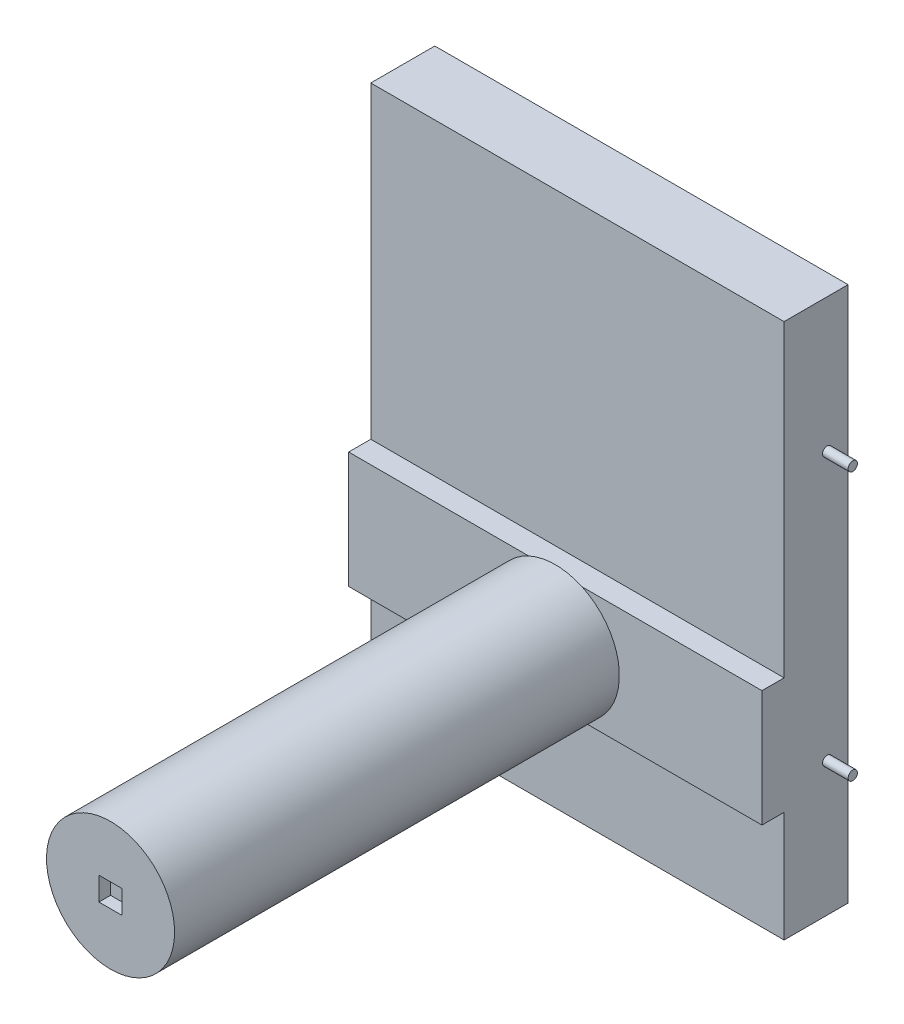
ISO-10303-21;
HEADER;
FILE_DESCRIPTION(('STEP AP214'),'2;1');
FILE_NAME('part.step','',(''),(''),'','','');
FILE_SCHEMA(('AUTOMOTIVE_DESIGN { 1 0 10303 214 1 1 1 1 }'));
ENDSEC;
DATA;
#1=APPLICATION_CONTEXT('core data for automotive mechanical design processes');
#2=APPLICATION_PROTOCOL_DEFINITION('international standard','automotive_design',2000,#1);
#3=PRODUCT_CONTEXT('',#1,'mechanical');
#4=PRODUCT('Part','Part','',(#3));
#5=PRODUCT_RELATED_PRODUCT_CATEGORY('part','',(#4));
#6=PRODUCT_DEFINITION_FORMATION('','',#4);
#7=PRODUCT_DEFINITION_CONTEXT('part definition',#1,'design');
#8=PRODUCT_DEFINITION('design','',#6,#7);
#9=PRODUCT_DEFINITION_SHAPE('','',#8);
#10=(LENGTH_UNIT() NAMED_UNIT(*) SI_UNIT(.MILLI.,.METRE.));
#11=(NAMED_UNIT(*) PLANE_ANGLE_UNIT() SI_UNIT($,.RADIAN.));
#12=(NAMED_UNIT(*) SI_UNIT($,.STERADIAN.) SOLID_ANGLE_UNIT());
#13=UNCERTAINTY_MEASURE_WITH_UNIT(LENGTH_MEASURE(1.E-05),#10,'distance_accuracy_value','');
#14=(GEOMETRIC_REPRESENTATION_CONTEXT(3) GLOBAL_UNCERTAINTY_ASSIGNED_CONTEXT((#13)) GLOBAL_UNIT_ASSIGNED_CONTEXT((#10,
#11,#12)) REPRESENTATION_CONTEXT('',''));
#15=CARTESIAN_POINT('',(0.,0.,0.));
#16=DIRECTION('',(0.,0.,1.));
#17=DIRECTION('',(1.,0.,0.));
#18=AXIS2_PLACEMENT_3D('',#15,#16,#17);
#19=CARTESIAN_POINT('',(177.500000000291,144.999998807907,487.999998748302));
#20=DIRECTION('',(0.,0.,1.));
#21=DIRECTION('',(1.,0.,0.));
#22=AXIS2_PLACEMENT_3D('',#19,#20,#21);
#23=PLANE('',#22);
#24=CARTESIAN_POINT('',(177.500000000291,144.999998807907,487.999998748302));
#25=DIRECTION('',(0.,0.,1.));
#26=DIRECTION('',(1.,0.,0.));
#27=AXIS2_PLACEMENT_3D('',#24,#25,#26);
#28=CIRCLE('',#27,55.);
#29=CARTESIAN_POINT('',(232.500000000291,144.999998807907,487.999998748302));
#30=VERTEX_POINT('',#29);
#31=EDGE_CURVE('E169',#30,#30,#28,.T.);
#32=ORIENTED_EDGE('',*,*,#31,.T.);
#33=EDGE_LOOP('',(#32));
#34=FACE_BOUND('',#33,.T.);
#35=DIRECTION('',(0.,-1.,0.));
#36=VECTOR('',#35,1.);
#37=CARTESIAN_POINT('',(187.500000000291,169.999998807907,487.999998748302));
#38=LINE('',#37,#36);
#39=CARTESIAN_POINT('',(187.500000000291,154.999998807907,487.999998748302));
#40=VERTEX_POINT('',#39);
#41=CARTESIAN_POINT('',(187.500000000291,134.999998807907,487.999998748302));
#42=VERTEX_POINT('',#41);
#43=EDGE_CURVE('E189',#40,#42,#38,.T.);
#44=ORIENTED_EDGE('',*,*,#43,.T.);
#45=DIRECTION('',(-1.,0.,0.));
#46=VECTOR('',#45,1.);
#47=CARTESIAN_POINT('',(177.500000000291,134.999998807907,487.999998748302));
#48=LINE('',#47,#46);
#49=CARTESIAN_POINT('',(167.500000000291,134.999998807907,487.999998748302));
#50=VERTEX_POINT('',#49);
#51=EDGE_CURVE('E54',#42,#50,#48,.T.);
#52=ORIENTED_EDGE('',*,*,#51,.T.);
#53=DIRECTION('',(0.,-1.,0.));
#54=VECTOR('',#53,1.);
#55=CARTESIAN_POINT('',(167.500000000291,169.999998807907,487.999998748302));
#56=LINE('',#55,#54);
#57=CARTESIAN_POINT('',(167.500000000291,154.999998807907,487.999998748302));
#58=VERTEX_POINT('',#57);
#59=EDGE_CURVE('E190',#58,#50,#56,.T.);
#60=ORIENTED_EDGE('',*,*,#59,.F.);
#61=DIRECTION('',(-1.,0.,0.));
#62=VECTOR('',#61,1.);
#63=CARTESIAN_POINT('',(177.500000000291,154.999998807907,487.999998748302));
#64=LINE('',#63,#62);
#65=EDGE_CURVE('E186',#40,#58,#64,.T.);
#66=ORIENTED_EDGE('',*,*,#65,.F.);
#67=EDGE_LOOP('',(#44,#52,#60,#66));
#68=FACE_BOUND('',#67,.T.);
#69=ADVANCED_FACE('F36',(#34,#68),#23,.T.);
#70=CARTESIAN_POINT('',(2.91378032812872E-10,194.999992847443,105.999998748302));
#71=DIRECTION('',(0.,0.,1.));
#72=DIRECTION('',(1.,0.,0.));
#73=AXIS2_PLACEMENT_3D('',#70,#71,#72);
#74=PLANE('',#73);
#75=CARTESIAN_POINT('',(177.500000000291,144.999998807907,105.999998748302));
#76=DIRECTION('',(0.,0.,1.));
#77=DIRECTION('',(1.,0.,0.));
#78=AXIS2_PLACEMENT_3D('',#75,#76,#77);
#79=CIRCLE('',#78,55.);
#80=CARTESIAN_POINT('',(154.587108518717,194.999992847443,105.999998748302));
#81=VERTEX_POINT('',#80);
#82=CARTESIAN_POINT('',(154.587121525512,94.9999988079071,105.999998748302));
#83=VERTEX_POINT('',#82);
#84=EDGE_CURVE('E12',#81,#83,#79,.T.);
#85=ORIENTED_EDGE('',*,*,#84,.F.);
#86=DIRECTION('',(1.,0.,0.));
#87=VECTOR('',#86,1.);
#88=CARTESIAN_POINT('',(2.91378032812872E-10,194.999992847443,105.999998748302));
#89=LINE('',#88,#87);
#90=CARTESIAN_POINT('',(2.91378032812872E-10,194.999992847443,105.999998748302));
#91=VERTEX_POINT('',#90);
#92=EDGE_CURVE('E149',#91,#81,#89,.T.);
#93=ORIENTED_EDGE('',*,*,#92,.F.);
#94=DIRECTION('',(0.,-1.,0.));
#95=VECTOR('',#94,1.);
#96=CARTESIAN_POINT('',(2.91378032812872E-10,194.999992847443,105.999998748302));
#97=LINE('',#96,#95);
#98=CARTESIAN_POINT('',(2.91378032812872E-10,94.9999988079071,105.999998748302));
#99=VERTEX_POINT('',#98);
#100=EDGE_CURVE('E548',#91,#99,#97,.T.);
#101=ORIENTED_EDGE('',*,*,#100,.T.);
#102=DIRECTION('',(1.,0.,0.));
#103=VECTOR('',#102,1.);
#104=CARTESIAN_POINT('',(2.91378032812872E-10,94.9999988079071,105.999998748302));
#105=LINE('',#104,#103);
#106=EDGE_CURVE('E151',#99,#83,#105,.T.);
#107=ORIENTED_EDGE('',*,*,#106,.T.);
#108=EDGE_LOOP('',(#85,#93,#101,#107));
#109=FACE_BOUND('',#108,.T.);
#110=ADVANCED_FACE('F147',(#109),#74,.T.);
#111=CARTESIAN_POINT('',(2.91378032812872E-10,-2.52683671275527E-12,32.0000015199184));
#112=DIRECTION('',(0.,0.,-1.));
#113=DIRECTION('',(-1.,0.,0.));
#114=AXIS2_PLACEMENT_3D('',#111,#112,#113);
#115=PLANE('',#114);
#116=DIRECTION('',(0.,1.,0.));
#117=VECTOR('',#116,1.);
#118=CARTESIAN_POINT('',(354.999989271164,-2.52683671275527E-12,32.0000015199184));
#119=LINE('',#118,#117);
#120=CARTESIAN_POINT('',(354.999989271164,-2.52683671275527E-12,32.0000015199184));
#121=VERTEX_POINT('',#120);
#122=CARTESIAN_POINT('',(354.999989271164,460.00000834465,32.0000015199184));
#123=VERTEX_POINT('',#122);
#124=EDGE_CURVE('E504',#121,#123,#119,.T.);
#125=ORIENTED_EDGE('',*,*,#124,.F.);
#126=DIRECTION('',(1.,0.,0.));
#127=VECTOR('',#126,1.);
#128=CARTESIAN_POINT('',(2.91378032812872E-10,-2.52683671275527E-12,32.0000015199184));
#129=LINE('',#128,#127);
#130=CARTESIAN_POINT('',(2.91378032812872E-10,-2.52683671275527E-12,32.0000015199184));
#131=VERTEX_POINT('',#130);
#132=EDGE_CURVE('E182',#131,#121,#129,.T.);
#133=ORIENTED_EDGE('',*,*,#132,.F.);
#134=DIRECTION('',(0.,1.,0.));
#135=VECTOR('',#134,1.);
#136=CARTESIAN_POINT('',(2.91378032812872E-10,-2.52683671275527E-12,32.0000015199184));
#137=LINE('',#136,#135);
#138=CARTESIAN_POINT('',(2.91378032812872E-10,460.00000834465,32.0000015199184));
#139=VERTEX_POINT('',#138);
#140=EDGE_CURVE('E529',#131,#139,#137,.T.);
#141=ORIENTED_EDGE('',*,*,#140,.T.);
#142=DIRECTION('',(1.,0.,0.));
#143=VECTOR('',#142,1.);
#144=CARTESIAN_POINT('',(2.91378032812872E-10,460.00000834465,32.0000015199184));
#145=LINE('',#144,#143);
#146=EDGE_CURVE('E490',#139,#123,#145,.T.);
#147=ORIENTED_EDGE('',*,*,#146,.T.);
#148=EDGE_LOOP('',(#125,#133,#141,#147));
#149=FACE_BOUND('',#148,.T.);
#150=ADVANCED_FACE('F227',(#149),#115,.T.);
#151=CARTESIAN_POINT('',(2.91378032812872E-10,-2.57180950357326E-12,86.9999974966049));
#152=DIRECTION('',(0.,-1.,0.));
#153=DIRECTION('',(0.,0.,-1.));
#154=AXIS2_PLACEMENT_3D('',#151,#152,#153);
#155=PLANE('',#154);
#156=DIRECTION('',(0.,0.,-1.));
#157=VECTOR('',#156,1.);
#158=CARTESIAN_POINT('',(354.999989271164,-2.57180950357326E-12,86.9999974966049));
#159=LINE('',#158,#157);
#160=CARTESIAN_POINT('',(354.999989271164,-2.57180950357326E-12,86.9999974966049));
#161=VERTEX_POINT('',#160);
#162=EDGE_CURVE('E526',#161,#121,#159,.T.);
#163=ORIENTED_EDGE('',*,*,#162,.F.);
#164=DIRECTION('',(1.,0.,0.));
#165=VECTOR('',#164,1.);
#166=CARTESIAN_POINT('',(2.91378032812872E-10,-2.57180950357326E-12,86.9999974966049));
#167=LINE('',#166,#165);
#168=CARTESIAN_POINT('',(2.91378032812872E-10,-2.57180950357326E-12,86.9999974966049));
#169=VERTEX_POINT('',#168);
#170=EDGE_CURVE('E530',#169,#161,#167,.T.);
#171=ORIENTED_EDGE('',*,*,#170,.F.);
#172=DIRECTION('',(0.,0.,-1.));
#173=VECTOR('',#172,1.);
#174=CARTESIAN_POINT('',(2.91378032812872E-10,-2.57180950357326E-12,86.9999974966049));
#175=LINE('',#174,#173);
#176=EDGE_CURVE('E491',#169,#131,#175,.T.);
#177=ORIENTED_EDGE('',*,*,#176,.T.);
#178=ORIENTED_EDGE('',*,*,#132,.T.);
#179=EDGE_LOOP('',(#163,#171,#177,#178));
#180=FACE_BOUND('',#179,.T.);
#181=ADVANCED_FACE('F280',(#180),#155,.T.);
#182=CARTESIAN_POINT('',(2.91378032812872E-10,94.9999988079071,86.9999974966049));
#183=DIRECTION('',(0.,0.,1.));
#184=DIRECTION('',(1.,0.,0.));
#185=AXIS2_PLACEMENT_3D('',#182,#183,#184);
#186=PLANE('',#185);
#187=DIRECTION('',(0.,-1.,0.));
#188=VECTOR('',#187,1.);
#189=CARTESIAN_POINT('',(354.999989271164,94.9999988079071,86.9999974966049));
#190=LINE('',#189,#188);
#191=CARTESIAN_POINT('',(354.999989271164,94.9999988079071,86.9999974966049));
#192=VERTEX_POINT('',#191);
#193=EDGE_CURVE('E523',#192,#161,#190,.T.);
#194=ORIENTED_EDGE('',*,*,#193,.F.);
#195=DIRECTION('',(1.,0.,0.));
#196=VECTOR('',#195,1.);
#197=CARTESIAN_POINT('',(2.91378032812872E-10,94.9999988079071,86.9999974966049));
#198=LINE('',#197,#196);
#199=CARTESIAN_POINT('',(2.91378032812872E-10,94.9999988079071,86.9999974966049));
#200=VERTEX_POINT('',#199);
#201=EDGE_CURVE('E483',#200,#192,#198,.T.);
#202=ORIENTED_EDGE('',*,*,#201,.F.);
#203=DIRECTION('',(0.,-1.,0.));
#204=VECTOR('',#203,1.);
#205=CARTESIAN_POINT('',(2.91378032812872E-10,94.9999988079071,86.9999974966049));
#206=LINE('',#205,#204);
#207=EDGE_CURVE('E496',#200,#169,#206,.T.);
#208=ORIENTED_EDGE('',*,*,#207,.T.);
#209=ORIENTED_EDGE('',*,*,#170,.T.);
#210=EDGE_LOOP('',(#194,#202,#208,#209));
#211=FACE_BOUND('',#210,.T.);
#212=ADVANCED_FACE('F283',(#211),#186,.T.);
#213=CARTESIAN_POINT('',(2.91378032812872E-10,94.9999988079071,105.999998748302));
#214=DIRECTION('',(0.,-1.,0.));
#215=DIRECTION('',(0.,0.,-1.));
#216=AXIS2_PLACEMENT_3D('',#213,#214,#215);
#217=PLANE('',#216);
#218=DIRECTION('',(0.,0.,-1.));
#219=VECTOR('',#218,1.);
#220=CARTESIAN_POINT('',(354.999989271164,94.9999988079071,105.999998748302));
#221=LINE('',#220,#219);
#222=CARTESIAN_POINT('',(354.999989271164,94.9999988079071,105.999998748302));
#223=VERTEX_POINT('',#222);
#224=EDGE_CURVE('E520',#223,#192,#221,.T.);
#225=ORIENTED_EDGE('',*,*,#224,.F.);
#226=CARTESIAN_POINT('',(200.412878475071,94.9999988079071,105.999998748302));
#227=VERTEX_POINT('',#226);
#228=EDGE_CURVE('E161',#227,#223,#105,.T.);
#229=ORIENTED_EDGE('',*,*,#228,.F.);
#230=EDGE_CURVE('E481',#83,#227,#105,.T.);
#231=ORIENTED_EDGE('',*,*,#230,.F.);
#232=ORIENTED_EDGE('',*,*,#106,.F.);
#233=DIRECTION('',(0.,0.,-1.));
#234=VECTOR('',#233,1.);
#235=CARTESIAN_POINT('',(2.91378032812872E-10,94.9999988079071,105.999998748302));
#236=LINE('',#235,#234);
#237=EDGE_CURVE('E500',#99,#200,#236,.T.);
#238=ORIENTED_EDGE('',*,*,#237,.T.);
#239=ORIENTED_EDGE('',*,*,#201,.T.);
#240=EDGE_LOOP('',(#225,#229,#231,#232,#238,#239));
#241=FACE_BOUND('',#240,.T.);
#242=ADVANCED_FACE('F287',(#241),#217,.T.);
#243=CARTESIAN_POINT('',(200.412891481866,194.999992847443,105.999998748302));
#244=VERTEX_POINT('',#243);
#245=EDGE_CURVE('E45',#227,#244,#79,.T.);
#246=ORIENTED_EDGE('',*,*,#245,.F.);
#247=ORIENTED_EDGE('',*,*,#228,.T.);
#248=DIRECTION('',(0.,-1.,0.));
#249=VECTOR('',#248,1.);
#250=CARTESIAN_POINT('',(354.999989271164,194.999992847443,105.999998748302));
#251=LINE('',#250,#249);
#252=CARTESIAN_POINT('',(354.999989271164,194.999992847443,105.999998748302));
#253=VERTEX_POINT('',#252);
#254=EDGE_CURVE('E517',#253,#223,#251,.T.);
#255=ORIENTED_EDGE('',*,*,#254,.F.);
#256=EDGE_CURVE('E163',#244,#253,#89,.T.);
#257=ORIENTED_EDGE('',*,*,#256,.F.);
#258=EDGE_LOOP('',(#246,#247,#255,#257));
#259=FACE_BOUND('',#258,.T.);
#260=ADVANCED_FACE('F229',(#259),#74,.T.);
#261=CARTESIAN_POINT('',(2.91378032812872E-10,194.999992847443,86.9999974966049));
#262=DIRECTION('',(0.,1.,0.));
#263=DIRECTION('',(0.,0.,1.));
#264=AXIS2_PLACEMENT_3D('',#261,#262,#263);
#265=PLANE('',#264);
#266=DIRECTION('',(0.,0.,1.));
#267=VECTOR('',#266,1.);
#268=CARTESIAN_POINT('',(354.999989271164,194.999992847443,86.9999974966049));
#269=LINE('',#268,#267);
#270=CARTESIAN_POINT('',(354.999989271164,194.999992847443,86.9999974966049));
#271=VERTEX_POINT('',#270);
#272=EDGE_CURVE('E514',#271,#253,#269,.T.);
#273=ORIENTED_EDGE('',*,*,#272,.F.);
#274=DIRECTION('',(1.,0.,0.));
#275=VECTOR('',#274,1.);
#276=CARTESIAN_POINT('',(2.91378032812872E-10,194.999992847443,86.9999974966049));
#277=LINE('',#276,#275);
#278=CARTESIAN_POINT('',(2.91378032812872E-10,194.999992847443,86.9999974966049));
#279=VERTEX_POINT('',#278);
#280=EDGE_CURVE('E487',#279,#271,#277,.T.);
#281=ORIENTED_EDGE('',*,*,#280,.F.);
#282=DIRECTION('',(0.,0.,1.));
#283=VECTOR('',#282,1.);
#284=CARTESIAN_POINT('',(2.91378032812872E-10,194.999992847443,86.9999974966049));
#285=LINE('',#284,#283);
#286=EDGE_CURVE('E160',#279,#91,#285,.T.);
#287=ORIENTED_EDGE('',*,*,#286,.T.);
#288=ORIENTED_EDGE('',*,*,#92,.T.);
#289=EDGE_CURVE('E98',#81,#244,#89,.T.);
#290=ORIENTED_EDGE('',*,*,#289,.T.);
#291=ORIENTED_EDGE('',*,*,#256,.T.);
#292=EDGE_LOOP('',(#273,#281,#287,#288,#290,#291));
#293=FACE_BOUND('',#292,.T.);
#294=ADVANCED_FACE('F158',(#293),#265,.T.);
#295=CARTESIAN_POINT('',(2.91378032812872E-10,460.00000834465,86.9999974966049));
#296=DIRECTION('',(0.,0.,1.));
#297=DIRECTION('',(1.,0.,0.));
#298=AXIS2_PLACEMENT_3D('',#295,#296,#297);
#299=PLANE('',#298);
#300=DIRECTION('',(0.,-1.,0.));
#301=VECTOR('',#300,1.);
#302=CARTESIAN_POINT('',(354.999989271164,460.00000834465,86.9999974966049));
#303=LINE('',#302,#301);
#304=CARTESIAN_POINT('',(354.999989271164,460.00000834465,86.9999974966049));
#305=VERTEX_POINT('',#304);
#306=EDGE_CURVE('E511',#305,#271,#303,.T.);
#307=ORIENTED_EDGE('',*,*,#306,.F.);
#308=DIRECTION('',(1.,0.,0.));
#309=VECTOR('',#308,1.);
#310=CARTESIAN_POINT('',(2.91378032812872E-10,460.00000834465,86.9999974966049));
#311=LINE('',#310,#309);
#312=CARTESIAN_POINT('',(2.91378032812872E-10,460.00000834465,86.9999974966049));
#313=VERTEX_POINT('',#312);
#314=EDGE_CURVE('E489',#313,#305,#311,.T.);
#315=ORIENTED_EDGE('',*,*,#314,.F.);
#316=DIRECTION('',(0.,-1.,0.));
#317=VECTOR('',#316,1.);
#318=CARTESIAN_POINT('',(2.91378032812872E-10,460.00000834465,86.9999974966049));
#319=LINE('',#318,#317);
#320=EDGE_CURVE('E542',#313,#279,#319,.T.);
#321=ORIENTED_EDGE('',*,*,#320,.T.);
#322=ORIENTED_EDGE('',*,*,#280,.T.);
#323=EDGE_LOOP('',(#307,#315,#321,#322));
#324=FACE_BOUND('',#323,.T.);
#325=ADVANCED_FACE('F295',(#324),#299,.T.);
#326=CARTESIAN_POINT('',(2.91378032812872E-10,460.00000834465,32.0000015199184));
#327=DIRECTION('',(0.,1.,0.));
#328=DIRECTION('',(0.,0.,1.));
#329=AXIS2_PLACEMENT_3D('',#326,#327,#328);
#330=PLANE('',#329);
#331=DIRECTION('',(0.,0.,1.));
#332=VECTOR('',#331,1.);
#333=CARTESIAN_POINT('',(354.999989271164,460.00000834465,32.0000015199184));
#334=LINE('',#333,#332);
#335=EDGE_CURVE('E507',#123,#305,#334,.T.);
#336=ORIENTED_EDGE('',*,*,#335,.F.);
#337=ORIENTED_EDGE('',*,*,#146,.F.);
#338=DIRECTION('',(0.,0.,1.));
#339=VECTOR('',#338,1.);
#340=CARTESIAN_POINT('',(2.91378032812872E-10,460.00000834465,32.0000015199184));
#341=LINE('',#340,#339);
#342=EDGE_CURVE('E546',#139,#313,#341,.T.);
#343=ORIENTED_EDGE('',*,*,#342,.T.);
#344=ORIENTED_EDGE('',*,*,#314,.T.);
#345=EDGE_LOOP('',(#336,#337,#343,#344));
#346=FACE_BOUND('',#345,.T.);
#347=ADVANCED_FACE('F275',(#346),#330,.T.);
#348=CARTESIAN_POINT('',(2.91378032812872E-10,0.,0.));
#349=DIRECTION('',(1.,0.,0.));
#350=DIRECTION('',(0.,0.,-1.));
#351=AXIS2_PLACEMENT_3D('',#348,#349,#350);
#352=PLANE('',#351);
#353=CARTESIAN_POINT('',(2.91378032812872E-10,345.00000834465,50.0000015199185));
#354=DIRECTION('',(1.,0.,0.));
#355=DIRECTION('',(0.,0.,-1.));
#356=AXIS2_PLACEMENT_3D('',#353,#354,#355);
#357=CIRCLE('',#356,4.00000000000001);
#358=CARTESIAN_POINT('',(2.91378032812872E-10,345.00000834465,46.0000015199185));
#359=VERTEX_POINT('',#358);
#360=EDGE_CURVE('E175',#359,#359,#357,.F.);
#361=ORIENTED_EDGE('',*,*,#360,.F.);
#362=EDGE_LOOP('',(#361));
#363=FACE_BOUND('',#362,.T.);
#364=CARTESIAN_POINT('',(2.91378032812872E-10,114.999999999997,50.0000015199184));
#365=DIRECTION('',(1.,0.,0.));
#366=DIRECTION('',(0.,0.,-1.));
#367=AXIS2_PLACEMENT_3D('',#364,#365,#366);
#368=CIRCLE('',#367,4.00000000000001);
#369=CARTESIAN_POINT('',(2.91378032812872E-10,114.999999999997,46.0000015199184));
#370=VERTEX_POINT('',#369);
#371=EDGE_CURVE('E177',#370,#370,#368,.F.);
#372=ORIENTED_EDGE('',*,*,#371,.F.);
#373=EDGE_LOOP('',(#372));
#374=FACE_BOUND('',#373,.T.);
#375=ORIENTED_EDGE('',*,*,#140,.F.);
#376=ORIENTED_EDGE('',*,*,#176,.F.);
#377=ORIENTED_EDGE('',*,*,#207,.F.);
#378=ORIENTED_EDGE('',*,*,#237,.F.);
#379=ORIENTED_EDGE('',*,*,#100,.F.);
#380=ORIENTED_EDGE('',*,*,#286,.F.);
#381=ORIENTED_EDGE('',*,*,#320,.F.);
#382=ORIENTED_EDGE('',*,*,#342,.F.);
#383=EDGE_LOOP('',(#375,#376,#377,#378,#379,#380,#381,#382));
#384=FACE_BOUND('',#383,.T.);
#385=ADVANCED_FACE('F272',(#363,#374,#384),#352,.F.);
#386=CARTESIAN_POINT('',(354.999989271164,0.,0.));
#387=DIRECTION('',(1.,0.,0.));
#388=DIRECTION('',(0.,0.,-1.));
#389=AXIS2_PLACEMENT_3D('',#386,#387,#388);
#390=PLANE('',#389);
#391=CARTESIAN_POINT('',(354.999989271164,114.999999999997,50.0000015199184));
#392=DIRECTION('',(1.,0.,0.));
#393=DIRECTION('',(0.,0.,-1.));
#394=AXIS2_PLACEMENT_3D('',#391,#392,#393);
#395=CIRCLE('',#394,4.00000000000001);
#396=CARTESIAN_POINT('',(354.999989271164,114.999999999997,46.0000015199184));
#397=VERTEX_POINT('',#396);
#398=EDGE_CURVE('E561',#397,#397,#395,.T.);
#399=ORIENTED_EDGE('',*,*,#398,.F.);
#400=EDGE_LOOP('',(#399));
#401=FACE_BOUND('',#400,.T.);
#402=CARTESIAN_POINT('',(354.999989271164,345.00000834465,50.0000015199184));
#403=DIRECTION('',(1.,0.,0.));
#404=DIRECTION('',(0.,0.,-1.));
#405=AXIS2_PLACEMENT_3D('',#402,#403,#404);
#406=CIRCLE('',#405,4.00000000000001);
#407=CARTESIAN_POINT('',(354.999989271164,345.00000834465,46.0000015199184));
#408=VERTEX_POINT('',#407);
#409=EDGE_CURVE('E555',#408,#408,#406,.T.);
#410=ORIENTED_EDGE('',*,*,#409,.F.);
#411=EDGE_LOOP('',(#410));
#412=FACE_BOUND('',#411,.T.);
#413=ORIENTED_EDGE('',*,*,#124,.T.);
#414=ORIENTED_EDGE('',*,*,#335,.T.);
#415=ORIENTED_EDGE('',*,*,#306,.T.);
#416=ORIENTED_EDGE('',*,*,#272,.T.);
#417=ORIENTED_EDGE('',*,*,#254,.T.);
#418=ORIENTED_EDGE('',*,*,#224,.T.);
#419=ORIENTED_EDGE('',*,*,#193,.T.);
#420=ORIENTED_EDGE('',*,*,#162,.T.);
#421=EDGE_LOOP('',(#413,#414,#415,#416,#417,#418,#419,#420));
#422=FACE_BOUND('',#421,.T.);
#423=ADVANCED_FACE('F270',(#401,#412,#422),#390,.T.);
#424=CARTESIAN_POINT('',(376.999989271164,345.00000834465,50.0000015199184));
#425=DIRECTION('',(-1.,0.,0.));
#426=DIRECTION('',(0.,0.,1.));
#427=AXIS2_PLACEMENT_3D('',#424,#425,#426);
#428=CYLINDRICAL_SURFACE('',#427,4.00000000000001);
#429=CARTESIAN_POINT('',(376.999989271164,345.00000834465,50.0000015199184));
#430=DIRECTION('',(1.,0.,0.));
#431=DIRECTION('',(0.,0.,-1.));
#432=AXIS2_PLACEMENT_3D('',#429,#430,#431);
#433=CIRCLE('',#432,4.00000000000001);
#434=CARTESIAN_POINT('',(376.999989271164,345.00000834465,46.0000015199184));
#435=VERTEX_POINT('',#434);
#436=EDGE_CURVE('E508',#435,#435,#433,.T.);
#437=ORIENTED_EDGE('',*,*,#436,.F.);
#438=EDGE_LOOP('',(#437));
#439=FACE_BOUND('',#438,.T.);
#440=ORIENTED_EDGE('',*,*,#409,.T.);
#441=EDGE_LOOP('',(#440));
#442=FACE_BOUND('',#441,.T.);
#443=ADVANCED_FACE('F266',(#439,#442),#428,.T.);
#444=CARTESIAN_POINT('',(376.999989271164,0.,0.));
#445=DIRECTION('',(1.,0.,0.));
#446=DIRECTION('',(0.,0.,-1.));
#447=AXIS2_PLACEMENT_3D('',#444,#445,#446);
#448=PLANE('',#447);
#449=ORIENTED_EDGE('',*,*,#436,.T.);
#450=EDGE_LOOP('',(#449));
#451=FACE_BOUND('',#450,.T.);
#452=ADVANCED_FACE('F262',(#451),#448,.T.);
#453=CARTESIAN_POINT('',(376.999989271164,114.999999999997,50.0000015199184));
#454=DIRECTION('',(-1.,0.,0.));
#455=DIRECTION('',(0.,0.,1.));
#456=AXIS2_PLACEMENT_3D('',#453,#454,#455);
#457=CYLINDRICAL_SURFACE('',#456,4.00000000000001);
#458=CARTESIAN_POINT('',(376.999989271164,114.999999999997,50.0000015199184));
#459=DIRECTION('',(1.,0.,0.));
#460=DIRECTION('',(0.,0.,-1.));
#461=AXIS2_PLACEMENT_3D('',#458,#459,#460);
#462=CIRCLE('',#461,4.00000000000001);
#463=CARTESIAN_POINT('',(376.999989271164,114.999999999997,46.0000015199184));
#464=VERTEX_POINT('',#463);
#465=EDGE_CURVE('E558',#464,#464,#462,.T.);
#466=ORIENTED_EDGE('',*,*,#465,.F.);
#467=EDGE_LOOP('',(#466));
#468=FACE_BOUND('',#467,.T.);
#469=ORIENTED_EDGE('',*,*,#398,.T.);
#470=EDGE_LOOP('',(#469));
#471=FACE_BOUND('',#470,.T.);
#472=ADVANCED_FACE('F258',(#468,#471),#457,.T.);
#473=CARTESIAN_POINT('',(376.999989271164,114.999999999997,50.0000015199184));
#474=DIRECTION('',(1.,0.,0.));
#475=DIRECTION('',(0.,0.,-1.));
#476=AXIS2_PLACEMENT_3D('',#473,#474,#475);
#477=PLANE('',#476);
#478=ORIENTED_EDGE('',*,*,#465,.T.);
#479=EDGE_LOOP('',(#478));
#480=FACE_BOUND('',#479,.T.);
#481=ADVANCED_FACE('F254',(#480),#477,.T.);
#482=CARTESIAN_POINT('',(-22.,114.999999999997,50.0000015199184));
#483=DIRECTION('',(1.,0.,0.));
#484=DIRECTION('',(0.,0.,-1.));
#485=AXIS2_PLACEMENT_3D('',#482,#483,#484);
#486=CYLINDRICAL_SURFACE('',#485,4.00000000000001);
#487=CARTESIAN_POINT('',(-22.,114.999999999997,50.0000015199184));
#488=DIRECTION('',(-1.,0.,0.));
#489=DIRECTION('',(0.,0.,1.));
#490=AXIS2_PLACEMENT_3D('',#487,#488,#489);
#491=CIRCLE('',#490,4.00000000000001);
#492=CARTESIAN_POINT('',(-22.,114.999999999997,54.0000015199184));
#493=VERTEX_POINT('',#492);
#494=EDGE_CURVE('E564',#493,#493,#491,.T.);
#495=ORIENTED_EDGE('',*,*,#494,.F.);
#496=EDGE_LOOP('',(#495));
#497=FACE_BOUND('',#496,.T.);
#498=ORIENTED_EDGE('',*,*,#371,.T.);
#499=EDGE_LOOP('',(#498));
#500=FACE_BOUND('',#499,.T.);
#501=ADVANCED_FACE('F250',(#497,#500),#486,.T.);
#502=CARTESIAN_POINT('',(-22.,114.999999999997,50.0000015199184));
#503=DIRECTION('',(-1.,0.,0.));
#504=DIRECTION('',(0.,0.,1.));
#505=AXIS2_PLACEMENT_3D('',#502,#503,#504);
#506=PLANE('',#505);
#507=ORIENTED_EDGE('',*,*,#494,.T.);
#508=EDGE_LOOP('',(#507));
#509=FACE_BOUND('',#508,.T.);
#510=ADVANCED_FACE('F246',(#509),#506,.T.);
#511=CARTESIAN_POINT('',(-22.,345.00000834465,50.0000015199185));
#512=DIRECTION('',(1.,0.,0.));
#513=DIRECTION('',(0.,0.,-1.));
#514=AXIS2_PLACEMENT_3D('',#511,#512,#513);
#515=CYLINDRICAL_SURFACE('',#514,4.00000000000001);
#516=CARTESIAN_POINT('',(-22.,345.00000834465,50.0000015199185));
#517=DIRECTION('',(-1.,0.,0.));
#518=DIRECTION('',(0.,0.,1.));
#519=AXIS2_PLACEMENT_3D('',#516,#517,#518);
#520=CIRCLE('',#519,4.00000000000001);
#521=CARTESIAN_POINT('',(-22.,345.00000834465,54.0000015199185));
#522=VERTEX_POINT('',#521);
#523=EDGE_CURVE('E171',#522,#522,#520,.T.);
#524=ORIENTED_EDGE('',*,*,#523,.F.);
#525=EDGE_LOOP('',(#524));
#526=FACE_BOUND('',#525,.T.);
#527=ORIENTED_EDGE('',*,*,#360,.T.);
#528=EDGE_LOOP('',(#527));
#529=FACE_BOUND('',#528,.T.);
#530=ADVANCED_FACE('F242',(#526,#529),#515,.T.);
#531=CARTESIAN_POINT('',(-22.,345.00000834465,50.0000015199185));
#532=DIRECTION('',(-1.,0.,0.));
#533=DIRECTION('',(0.,0.,1.));
#534=AXIS2_PLACEMENT_3D('',#531,#532,#533);
#535=PLANE('',#534);
#536=ORIENTED_EDGE('',*,*,#523,.T.);
#537=EDGE_LOOP('',(#536));
#538=FACE_BOUND('',#537,.T.);
#539=ADVANCED_FACE('F239',(#538),#535,.T.);
#540=CARTESIAN_POINT('',(177.500000000291,144.999998807907,105.999998748302));
#541=DIRECTION('',(0.,0.,1.));
#542=DIRECTION('',(1.,0.,0.));
#543=AXIS2_PLACEMENT_3D('',#540,#541,#542);
#544=PLANE('',#543);
#545=EDGE_CURVE('E47',#83,#227,#79,.T.);
#546=ORIENTED_EDGE('',*,*,#545,.F.);
#547=ORIENTED_EDGE('',*,*,#230,.T.);
#548=EDGE_LOOP('',(#546,#547));
#549=FACE_BOUND('',#548,.T.);
#550=ADVANCED_FACE('F235',(#549),#544,.F.);
#551=CARTESIAN_POINT('',(177.500000000291,144.999998807907,487.999998748302));
#552=DIRECTION('',(0.,0.,-1.));
#553=DIRECTION('',(-1.,0.,0.));
#554=AXIS2_PLACEMENT_3D('',#551,#552,#553);
#555=CYLINDRICAL_SURFACE('',#554,55.);
#556=ORIENTED_EDGE('',*,*,#31,.F.);
#557=EDGE_LOOP('',(#556));
#558=FACE_BOUND('',#557,.T.);
#559=EDGE_CURVE('E167',#244,#81,#79,.T.);
#560=ORIENTED_EDGE('',*,*,#559,.T.);
#561=ORIENTED_EDGE('',*,*,#84,.T.);
#562=ORIENTED_EDGE('',*,*,#545,.T.);
#563=ORIENTED_EDGE('',*,*,#245,.T.);
#564=EDGE_LOOP('',(#560,#561,#562,#563));
#565=FACE_BOUND('',#564,.T.);
#566=ADVANCED_FACE('F168',(#558,#565),#555,.T.);
#567=ORIENTED_EDGE('',*,*,#289,.F.);
#568=ORIENTED_EDGE('',*,*,#559,.F.);
#569=EDGE_LOOP('',(#567,#568));
#570=FACE_BOUND('',#569,.T.);
#571=ADVANCED_FACE('F166',(#570),#544,.F.);
#572=CARTESIAN_POINT('',(187.500000000291,134.999998807907,477.999998748302));
#573=DIRECTION('',(0.,1.,0.));
#574=DIRECTION('',(0.,0.,1.));
#575=AXIS2_PLACEMENT_3D('',#572,#573,#574);
#576=PLANE('',#575);
#577=ORIENTED_EDGE('',*,*,#51,.F.);
#578=DIRECTION('',(0.,0.,1.));
#579=VECTOR('',#578,1.);
#580=CARTESIAN_POINT('',(187.500000000291,134.999998807907,477.999998748302));
#581=LINE('',#580,#579);
#582=CARTESIAN_POINT('',(187.500000000291,134.999998807907,477.999998748302));
#583=VERTEX_POINT('',#582);
#584=EDGE_CURVE('E40',#583,#42,#581,.T.);
#585=ORIENTED_EDGE('',*,*,#584,.F.);
#586=DIRECTION('',(-1.,0.,0.));
#587=VECTOR('',#586,1.);
#588=CARTESIAN_POINT('',(0.,134.999998807907,477.999998748302));
#589=LINE('',#588,#587);
#590=CARTESIAN_POINT('',(167.500000000291,134.999998807907,477.999998748302));
#591=VERTEX_POINT('',#590);
#592=EDGE_CURVE('E200',#583,#591,#589,.T.);
#593=ORIENTED_EDGE('',*,*,#592,.T.);
#594=DIRECTION('',(0.,0.,1.));
#595=VECTOR('',#594,1.);
#596=CARTESIAN_POINT('',(167.500000000291,134.999998807907,477.999998748302));
#597=LINE('',#596,#595);
#598=EDGE_CURVE('E173',#591,#50,#597,.T.);
#599=ORIENTED_EDGE('',*,*,#598,.T.);
#600=EDGE_LOOP('',(#577,#585,#593,#599));
#601=FACE_BOUND('',#600,.T.);
#602=ADVANCED_FACE('F38',(#601),#576,.T.);
#603=CARTESIAN_POINT('',(167.500000000291,169.999998807907,477.999998748302));
#604=DIRECTION('',(-1.,0.,0.));
#605=DIRECTION('',(0.,0.,1.));
#606=AXIS2_PLACEMENT_3D('',#603,#604,#605);
#607=PLANE('',#606);
#608=ORIENTED_EDGE('',*,*,#59,.T.);
#609=ORIENTED_EDGE('',*,*,#598,.F.);
#610=DIRECTION('',(0.,-1.,0.));
#611=VECTOR('',#610,1.);
#612=CARTESIAN_POINT('',(167.500000000291,169.999998807907,477.999998748302));
#613=LINE('',#612,#611);
#614=CARTESIAN_POINT('',(167.500000000291,154.999998807907,477.999998748302));
#615=VERTEX_POINT('',#614);
#616=EDGE_CURVE('E197',#615,#591,#613,.T.);
#617=ORIENTED_EDGE('',*,*,#616,.F.);
#618=DIRECTION('',(0.,0.,1.));
#619=VECTOR('',#618,1.);
#620=CARTESIAN_POINT('',(167.500000000291,154.999998807907,477.999998748302));
#621=LINE('',#620,#619);
#622=EDGE_CURVE('E193',#615,#58,#621,.T.);
#623=ORIENTED_EDGE('',*,*,#622,.T.);
#624=EDGE_LOOP('',(#608,#609,#617,#623));
#625=FACE_BOUND('',#624,.T.);
#626=ADVANCED_FACE('F219',(#625),#607,.F.);
#627=CARTESIAN_POINT('',(187.500000000291,154.999998807907,477.999998748302));
#628=DIRECTION('',(0.,1.,0.));
#629=DIRECTION('',(0.,0.,1.));
#630=AXIS2_PLACEMENT_3D('',#627,#628,#629);
#631=PLANE('',#630);
#632=ORIENTED_EDGE('',*,*,#65,.T.);
#633=ORIENTED_EDGE('',*,*,#622,.F.);
#634=DIRECTION('',(-1.,0.,0.));
#635=VECTOR('',#634,1.);
#636=CARTESIAN_POINT('',(0.,154.999998807907,477.999998748302));
#637=LINE('',#636,#635);
#638=CARTESIAN_POINT('',(187.500000000291,154.999998807907,477.999998748302));
#639=VERTEX_POINT('',#638);
#640=EDGE_CURVE('E194',#639,#615,#637,.T.);
#641=ORIENTED_EDGE('',*,*,#640,.F.);
#642=DIRECTION('',(0.,0.,1.));
#643=VECTOR('',#642,1.);
#644=CARTESIAN_POINT('',(187.500000000291,154.999998807907,477.999998748302));
#645=LINE('',#644,#643);
#646=EDGE_CURVE('E191',#639,#40,#645,.T.);
#647=ORIENTED_EDGE('',*,*,#646,.T.);
#648=EDGE_LOOP('',(#632,#633,#641,#647));
#649=FACE_BOUND('',#648,.T.);
#650=ADVANCED_FACE('F304',(#649),#631,.F.);
#651=CARTESIAN_POINT('',(187.500000000291,169.999998807907,477.999998748302));
#652=DIRECTION('',(-1.,0.,0.));
#653=DIRECTION('',(0.,0.,1.));
#654=AXIS2_PLACEMENT_3D('',#651,#652,#653);
#655=PLANE('',#654);
#656=ORIENTED_EDGE('',*,*,#43,.F.);
#657=ORIENTED_EDGE('',*,*,#646,.F.);
#658=DIRECTION('',(0.,-1.,0.));
#659=VECTOR('',#658,1.);
#660=CARTESIAN_POINT('',(187.500000000291,169.999998807907,477.999998748302));
#661=LINE('',#660,#659);
#662=EDGE_CURVE('E90',#639,#583,#661,.T.);
#663=ORIENTED_EDGE('',*,*,#662,.T.);
#664=ORIENTED_EDGE('',*,*,#584,.T.);
#665=EDGE_LOOP('',(#656,#657,#663,#664));
#666=FACE_BOUND('',#665,.T.);
#667=ADVANCED_FACE('F213',(#666),#655,.T.);
#668=CARTESIAN_POINT('',(0.,0.,477.999998748302));
#669=DIRECTION('',(0.,0.,1.));
#670=DIRECTION('',(1.,0.,0.));
#671=AXIS2_PLACEMENT_3D('',#668,#669,#670);
#672=PLANE('',#671);
#673=ORIENTED_EDGE('',*,*,#592,.F.);
#674=ORIENTED_EDGE('',*,*,#662,.F.);
#675=ORIENTED_EDGE('',*,*,#640,.T.);
#676=ORIENTED_EDGE('',*,*,#616,.T.);
#677=EDGE_LOOP('',(#673,#674,#675,#676));
#678=FACE_BOUND('',#677,.T.);
#679=ADVANCED_FACE('F215',(#678),#672,.T.);
#680=CLOSED_SHELL('',(#69,#110,#150,#181,#212,#242,#260,#294,#325,#347,#385,#423,#443,#452,#472,
#481,#501,#510,#530,#539,#550,#566,#571,#602,#626,#650,#667,#679));
#681=MANIFOLD_SOLID_BREP('B2',#680);
#682=ADVANCED_BREP_SHAPE_REPRESENTATION('',(#18,#681),#14);
#683=SHAPE_DEFINITION_REPRESENTATION(#9,#682);
ENDSEC;
END-ISO-10303-21;
